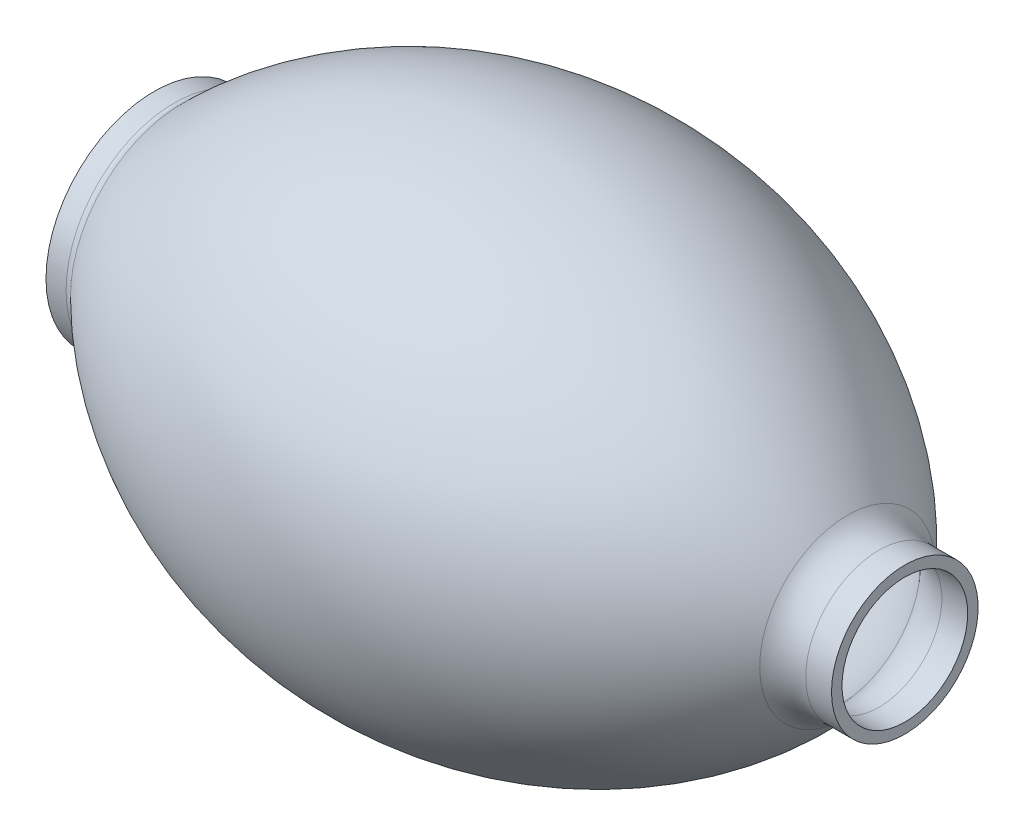
ISO-10303-21;
HEADER;
FILE_DESCRIPTION(('STEP AP214'),'2;1');
FILE_NAME('part.step','',(''),(''),'','','');
FILE_SCHEMA(('AUTOMOTIVE_DESIGN { 1 0 10303 214 1 1 1 1 }'));
ENDSEC;
DATA;
#1=APPLICATION_CONTEXT('core data for automotive mechanical design processes');
#2=APPLICATION_PROTOCOL_DEFINITION('international standard','automotive_design',2000,#1);
#3=PRODUCT_CONTEXT('',#1,'mechanical');
#4=PRODUCT('Part','Part','',(#3));
#5=PRODUCT_RELATED_PRODUCT_CATEGORY('part','',(#4));
#6=PRODUCT_DEFINITION_FORMATION('','',#4);
#7=PRODUCT_DEFINITION_CONTEXT('part definition',#1,'design');
#8=PRODUCT_DEFINITION('design','',#6,#7);
#9=PRODUCT_DEFINITION_SHAPE('','',#8);
#10=(LENGTH_UNIT() NAMED_UNIT(*) SI_UNIT(.MILLI.,.METRE.));
#11=(NAMED_UNIT(*) PLANE_ANGLE_UNIT() SI_UNIT($,.RADIAN.));
#12=(NAMED_UNIT(*) SI_UNIT($,.STERADIAN.) SOLID_ANGLE_UNIT());
#13=UNCERTAINTY_MEASURE_WITH_UNIT(LENGTH_MEASURE(1.E-05),#10,'distance_accuracy_value','');
#14=(GEOMETRIC_REPRESENTATION_CONTEXT(3) GLOBAL_UNCERTAINTY_ASSIGNED_CONTEXT((#13)) GLOBAL_UNIT_ASSIGNED_CONTEXT((#10,
#11,#12)) REPRESENTATION_CONTEXT('',''));
#15=CARTESIAN_POINT('',(0.,0.,0.));
#16=DIRECTION('',(0.,0.,1.));
#17=DIRECTION('',(1.,0.,0.));
#18=AXIS2_PLACEMENT_3D('',#15,#16,#17);
#19=CARTESIAN_POINT('',(-104.5,0.,0.));
#20=DIRECTION('',(-1.,0.,0.));
#21=DIRECTION('',(0.,0.,1.));
#22=AXIS2_PLACEMENT_3D('',#19,#20,#21);
#23=CYLINDRICAL_SURFACE('',#22,21.);
#24=CARTESIAN_POINT('',(110.5,0.,0.));
#25=DIRECTION('',(-1.,0.,0.));
#26=DIRECTION('',(0.,0.,1.));
#27=AXIS2_PLACEMENT_3D('',#24,#25,#26);
#28=CIRCLE('',#27,21.);
#29=CARTESIAN_POINT('',(110.5,0.,21.));
#30=VERTEX_POINT('',#29);
#31=EDGE_CURVE('E56',#30,#30,#28,.T.);
#32=ORIENTED_EDGE('',*,*,#31,.T.);
#33=EDGE_LOOP('',(#32));
#34=FACE_BOUND('',#33,.T.);
#35=CARTESIAN_POINT('',(103.113662929184,0.,0.));
#36=DIRECTION('',(-1.,0.,0.));
#37=DIRECTION('',(0.,0.,1.));
#38=AXIS2_PLACEMENT_3D('',#35,#36,#37);
#39=CIRCLE('',#38,21.);
#40=CARTESIAN_POINT('',(103.113662929184,0.,21.));
#41=VERTEX_POINT('',#40);
#42=EDGE_CURVE('E10',#41,#41,#39,.T.);
#43=ORIENTED_EDGE('',*,*,#42,.F.);
#44=EDGE_LOOP('',(#43));
#45=FACE_BOUND('',#44,.T.);
#46=ADVANCED_FACE('F34',(#34,#45),#23,.T.);
#47=CARTESIAN_POINT('',(103.113662929184,0.,0.));
#48=DIRECTION('',(-1.,0.,0.));
#49=DIRECTION('',(0.,0.,1.));
#50=AXIS2_PLACEMENT_3D('',#47,#48,#49);
#51=TOROIDAL_SURFACE('',#50,33.,12.);
#52=CARTESIAN_POINT('',(94.0588380866604,0.,0.));
#53=DIRECTION('',(-1.,0.,0.));
#54=DIRECTION('',(0.,0.,1.));
#55=AXIS2_PLACEMENT_3D('',#52,#53,#54);
#56=CIRCLE('',#55,25.1253478126829);
#57=CARTESIAN_POINT('',(94.0588380866604,0.,25.1253478126829));
#58=VERTEX_POINT('',#57);
#59=EDGE_CURVE('E40',#58,#58,#56,.T.);
#60=ORIENTED_EDGE('',*,*,#59,.F.);
#61=EDGE_LOOP('',(#60));
#62=FACE_BOUND('',#61,.T.);
#63=ORIENTED_EDGE('',*,*,#42,.T.);
#64=EDGE_LOOP('',(#63));
#65=FACE_BOUND('',#64,.T.);
#66=ADVANCED_FACE('F96',(#62,#65),#51,.F.);
#67=CARTESIAN_POINT('',(-4.43761212199616,0.,0.));
#68=DIRECTION('',(-1.,0.,0.));
#69=DIRECTION('',(0.,0.,1.));
#70=AXIS2_PLACEMENT_3D('',#67,#68,#69);
#71=DEGENERATE_TOROIDAL_SURFACE('',#70,60.5334363789252,130.533436378925,.F.);
#72=CARTESIAN_POINT('',(-96.6300189737862,0.,0.));
#73=DIRECTION('',(-1.,0.,0.));
#74=DIRECTION('',(0.,0.,1.));
#75=AXIS2_PLACEMENT_3D('',#72,#73,#74);
#76=CIRCLE('',#75,31.8761850452797);
#77=CARTESIAN_POINT('',(-96.6300189737862,0.,31.8761850452797));
#78=VERTEX_POINT('',#77);
#79=EDGE_CURVE('E44',#78,#78,#76,.T.);
#80=ORIENTED_EDGE('',*,*,#79,.F.);
#81=EDGE_LOOP('',(#80));
#82=FACE_BOUND('',#81,.T.);
#83=ORIENTED_EDGE('',*,*,#59,.T.);
#84=EDGE_LOOP('',(#83));
#85=FACE_BOUND('',#84,.T.);
#86=ADVANCED_FACE('F101',(#82,#85),#71,.F.);
#87=CARTESIAN_POINT('',(-98.7488417691386,0.,0.));
#88=DIRECTION('',(-1.,0.,0.));
#89=DIRECTION('',(0.,0.,1.));
#90=AXIS2_PLACEMENT_3D('',#87,#88,#89);
#91=TOROIDAL_SURFACE('',#90,34.,3.00000000000002);
#92=ORIENTED_EDGE('',*,*,#79,.T.);
#93=EDGE_LOOP('',(#92));
#94=FACE_BOUND('',#93,.T.);
#95=CARTESIAN_POINT('',(-98.7488417691386,0.,0.));
#96=DIRECTION('',(-1.,0.,0.));
#97=DIRECTION('',(0.,0.,1.));
#98=AXIS2_PLACEMENT_3D('',#95,#96,#97);
#99=CIRCLE('',#98,31.);
#100=CARTESIAN_POINT('',(-98.7488417691386,0.,31.));
#101=VERTEX_POINT('',#100);
#102=EDGE_CURVE('E48',#101,#101,#99,.T.);
#103=ORIENTED_EDGE('',*,*,#102,.F.);
#104=EDGE_LOOP('',(#103));
#105=FACE_BOUND('',#104,.T.);
#106=ADVANCED_FACE('F122',(#94,#105),#91,.F.);
#107=CARTESIAN_POINT('',(-104.5,0.,0.));
#108=DIRECTION('',(-1.,0.,0.));
#109=DIRECTION('',(0.,0.,1.));
#110=AXIS2_PLACEMENT_3D('',#107,#108,#109);
#111=CYLINDRICAL_SURFACE('',#110,31.);
#112=CARTESIAN_POINT('',(-104.5,0.,0.));
#113=DIRECTION('',(-1.,0.,0.));
#114=DIRECTION('',(0.,0.,1.));
#115=AXIS2_PLACEMENT_3D('',#112,#113,#114);
#116=CIRCLE('',#115,31.);
#117=CARTESIAN_POINT('',(-104.5,0.,31.));
#118=VERTEX_POINT('',#117);
#119=EDGE_CURVE('E53',#118,#118,#116,.T.);
#120=ORIENTED_EDGE('',*,*,#119,.F.);
#121=EDGE_LOOP('',(#120));
#122=FACE_BOUND('',#121,.T.);
#123=ORIENTED_EDGE('',*,*,#102,.T.);
#124=EDGE_LOOP('',(#123));
#125=FACE_BOUND('',#124,.T.);
#126=ADVANCED_FACE('F113',(#122,#125),#111,.T.);
#127=CARTESIAN_POINT('',(-104.5,0.,0.));
#128=DIRECTION('',(1.,0.,0.));
#129=DIRECTION('',(0.,0.,-1.));
#130=AXIS2_PLACEMENT_3D('',#127,#128,#129);
#131=PLANE('',#130);
#132=CARTESIAN_POINT('',(-104.5,0.,0.));
#133=DIRECTION('',(1.,0.,0.));
#134=DIRECTION('',(0.,0.,-1.));
#135=AXIS2_PLACEMENT_3D('',#132,#133,#134);
#136=CIRCLE('',#135,28.);
#137=CARTESIAN_POINT('',(-104.5,0.,-28.));
#138=VERTEX_POINT('',#137);
#139=EDGE_CURVE('E60',#138,#138,#136,.F.);
#140=ORIENTED_EDGE('',*,*,#139,.F.);
#141=EDGE_LOOP('',(#140));
#142=FACE_BOUND('',#141,.T.);
#143=ORIENTED_EDGE('',*,*,#119,.T.);
#144=EDGE_LOOP('',(#143));
#145=FACE_BOUND('',#144,.T.);
#146=ADVANCED_FACE('F107',(#142,#145),#131,.F.);
#147=CARTESIAN_POINT('',(110.5,0.,0.));
#148=DIRECTION('',(1.,0.,0.));
#149=DIRECTION('',(0.,0.,-1.));
#150=AXIS2_PLACEMENT_3D('',#147,#148,#149);
#151=PLANE('',#150);
#152=CARTESIAN_POINT('',(110.5,0.,0.));
#153=DIRECTION('',(1.,0.,0.));
#154=DIRECTION('',(0.,0.,-1.));
#155=AXIS2_PLACEMENT_3D('',#152,#153,#154);
#156=CIRCLE('',#155,18.);
#157=CARTESIAN_POINT('',(110.5,0.,-18.));
#158=VERTEX_POINT('',#157);
#159=EDGE_CURVE('E64',#158,#158,#156,.F.);
#160=ORIENTED_EDGE('',*,*,#159,.T.);
#161=EDGE_LOOP('',(#160));
#162=FACE_BOUND('',#161,.T.);
#163=ORIENTED_EDGE('',*,*,#31,.F.);
#164=EDGE_LOOP('',(#163));
#165=FACE_BOUND('',#164,.T.);
#166=ADVANCED_FACE('F92',(#162,#165),#151,.T.);
#167=CARTESIAN_POINT('',(-104.5,0.,0.));
#168=DIRECTION('',(-1.,0.,0.));
#169=DIRECTION('',(0.,0.,1.));
#170=AXIS2_PLACEMENT_3D('',#167,#168,#169);
#171=CYLINDRICAL_SURFACE('',#170,18.);
#172=ORIENTED_EDGE('',*,*,#159,.F.);
#173=EDGE_LOOP('',(#172));
#174=FACE_BOUND('',#173,.T.);
#175=CARTESIAN_POINT('',(103.113662929184,0.,0.));
#176=DIRECTION('',(-1.,0.,0.));
#177=DIRECTION('',(0.,0.,1.));
#178=AXIS2_PLACEMENT_3D('',#175,#176,#177);
#179=CIRCLE('',#178,18.);
#180=CARTESIAN_POINT('',(103.113662929184,0.,18.));
#181=VERTEX_POINT('',#180);
#182=EDGE_CURVE('E59',#181,#181,#179,.T.);
#183=ORIENTED_EDGE('',*,*,#182,.T.);
#184=EDGE_LOOP('',(#183));
#185=FACE_BOUND('',#184,.T.);
#186=ADVANCED_FACE('F78',(#174,#185),#171,.F.);
#187=CARTESIAN_POINT('',(103.113662929184,0.,0.));
#188=DIRECTION('',(-1.,0.,0.));
#189=DIRECTION('',(0.,0.,1.));
#190=AXIS2_PLACEMENT_3D('',#187,#188,#189);
#191=TOROIDAL_SURFACE('',#190,33.,15.);
#192=CARTESIAN_POINT('',(91.7951318760294,0.,0.));
#193=DIRECTION('',(-1.,0.,0.));
#194=DIRECTION('',(0.,0.,1.));
#195=AXIS2_PLACEMENT_3D('',#192,#193,#194);
#196=CIRCLE('',#195,23.1566847658536);
#197=CARTESIAN_POINT('',(91.7951318760294,0.,23.1566847658536));
#198=VERTEX_POINT('',#197);
#199=EDGE_CURVE('E72',#198,#198,#196,.T.);
#200=ORIENTED_EDGE('',*,*,#199,.T.);
#201=EDGE_LOOP('',(#200));
#202=FACE_BOUND('',#201,.T.);
#203=ORIENTED_EDGE('',*,*,#182,.F.);
#204=EDGE_LOOP('',(#203));
#205=FACE_BOUND('',#204,.T.);
#206=ADVANCED_FACE('F80',(#202,#205),#191,.T.);
#207=CARTESIAN_POINT('',(-4.43761212199616,0.,0.));
#208=DIRECTION('',(-1.,0.,0.));
#209=DIRECTION('',(0.,0.,1.));
#210=AXIS2_PLACEMENT_3D('',#207,#208,#209);
#211=DEGENERATE_TOROIDAL_SURFACE('',#210,60.5334363789252,127.533436378925,.F.);
#212=CARTESIAN_POINT('',(-94.5111961784334,0.,0.));
#213=DIRECTION('',(-1.,0.,0.));
#214=DIRECTION('',(0.,0.,1.));
#215=AXIS2_PLACEMENT_3D('',#212,#213,#214);
#216=CIRCLE('',#215,29.7523700905591);
#217=CARTESIAN_POINT('',(-94.5111961784334,0.,29.7523700905591));
#218=VERTEX_POINT('',#217);
#219=EDGE_CURVE('E69',#218,#218,#216,.T.);
#220=ORIENTED_EDGE('',*,*,#219,.T.);
#221=EDGE_LOOP('',(#220));
#222=FACE_BOUND('',#221,.T.);
#223=ORIENTED_EDGE('',*,*,#199,.F.);
#224=EDGE_LOOP('',(#223));
#225=FACE_BOUND('',#224,.T.);
#226=ADVANCED_FACE('F82',(#222,#225),#211,.T.);
#227=CARTESIAN_POINT('',(-98.7488417691386,0.,0.));
#228=DIRECTION('',(-1.,0.,0.));
#229=DIRECTION('',(0.,0.,1.));
#230=AXIS2_PLACEMENT_3D('',#227,#228,#229);
#231=TOROIDAL_SURFACE('',#230,34.,6.00000000000002);
#232=ORIENTED_EDGE('',*,*,#219,.F.);
#233=EDGE_LOOP('',(#232));
#234=FACE_BOUND('',#233,.T.);
#235=CARTESIAN_POINT('',(-98.7488417691386,0.,0.));
#236=DIRECTION('',(-1.,0.,0.));
#237=DIRECTION('',(0.,0.,1.));
#238=AXIS2_PLACEMENT_3D('',#235,#236,#237);
#239=CIRCLE('',#238,28.);
#240=CARTESIAN_POINT('',(-98.7488417691386,0.,28.));
#241=VERTEX_POINT('',#240);
#242=EDGE_CURVE('E63',#241,#241,#239,.T.);
#243=ORIENTED_EDGE('',*,*,#242,.T.);
#244=EDGE_LOOP('',(#243));
#245=FACE_BOUND('',#244,.T.);
#246=ADVANCED_FACE('F89',(#234,#245),#231,.T.);
#247=CARTESIAN_POINT('',(-104.5,0.,0.));
#248=DIRECTION('',(-1.,0.,0.));
#249=DIRECTION('',(0.,0.,1.));
#250=AXIS2_PLACEMENT_3D('',#247,#248,#249);
#251=CYLINDRICAL_SURFACE('',#250,28.);
#252=ORIENTED_EDGE('',*,*,#139,.T.);
#253=EDGE_LOOP('',(#252));
#254=FACE_BOUND('',#253,.T.);
#255=ORIENTED_EDGE('',*,*,#242,.F.);
#256=EDGE_LOOP('',(#255));
#257=FACE_BOUND('',#256,.T.);
#258=ADVANCED_FACE('F117',(#254,#257),#251,.F.);
#259=CLOSED_SHELL('',(#46,#66,#86,#106,#126,#146,#166,#186,#206,#226,#246,#258));
#260=MANIFOLD_SOLID_BREP('B2',#259);
#261=ADVANCED_BREP_SHAPE_REPRESENTATION('',(#18,#260),#14);
#262=SHAPE_DEFINITION_REPRESENTATION(#9,#261);
ENDSEC;
END-ISO-10303-21;
